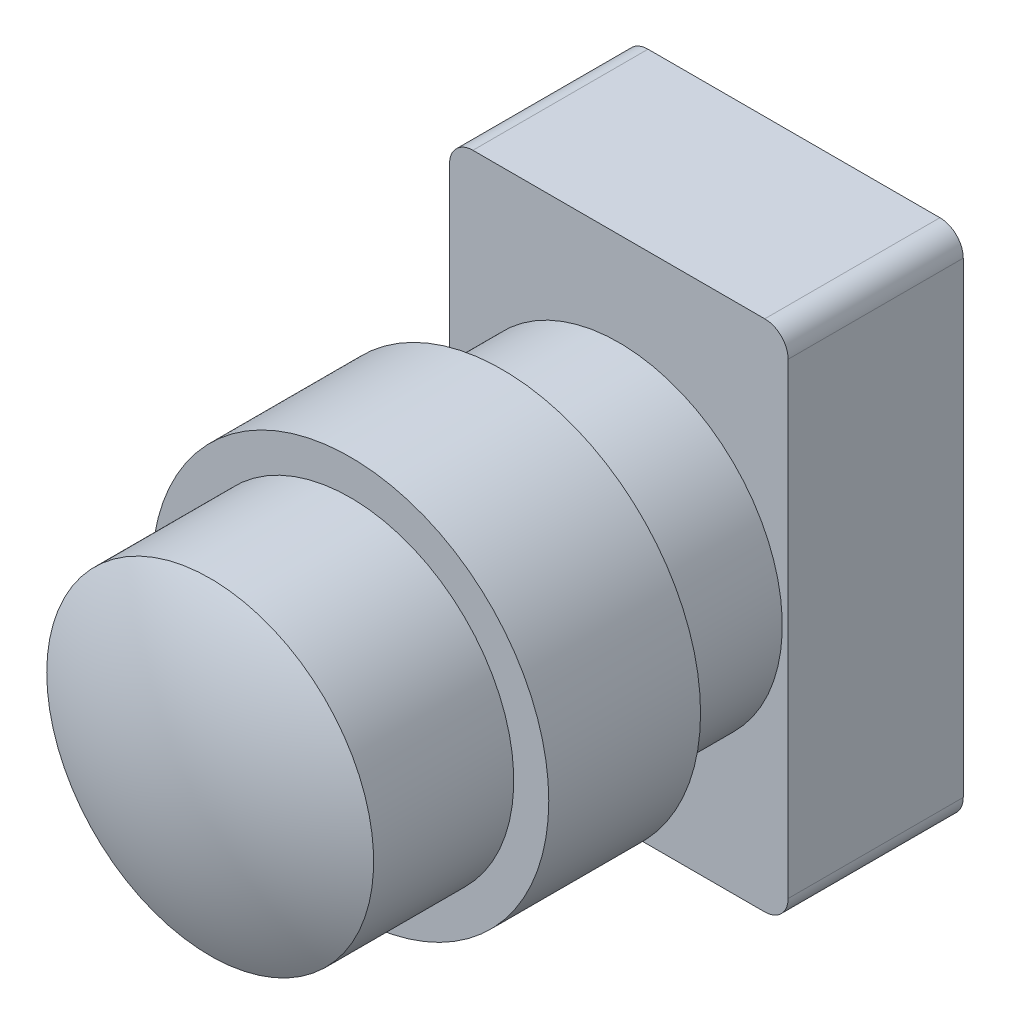
ISO-10303-21;
HEADER;
FILE_DESCRIPTION(('STEP AP214'),'2;1');
FILE_NAME('part.step','',(''),(''),'','','');
FILE_SCHEMA(('AUTOMOTIVE_DESIGN { 1 0 10303 214 1 1 1 1 }'));
ENDSEC;
DATA;
#1=APPLICATION_CONTEXT('core data for automotive mechanical design processes');
#2=APPLICATION_PROTOCOL_DEFINITION('international standard','automotive_design',2000,#1);
#3=PRODUCT_CONTEXT('',#1,'mechanical');
#4=PRODUCT('Part','Part','',(#3));
#5=PRODUCT_RELATED_PRODUCT_CATEGORY('part','',(#4));
#6=PRODUCT_DEFINITION_FORMATION('','',#4);
#7=PRODUCT_DEFINITION_CONTEXT('part definition',#1,'design');
#8=PRODUCT_DEFINITION('design','',#6,#7);
#9=PRODUCT_DEFINITION_SHAPE('','',#8);
#10=(LENGTH_UNIT() NAMED_UNIT(*) SI_UNIT(.MILLI.,.METRE.));
#11=(NAMED_UNIT(*) PLANE_ANGLE_UNIT() SI_UNIT($,.RADIAN.));
#12=(NAMED_UNIT(*) SI_UNIT($,.STERADIAN.) SOLID_ANGLE_UNIT());
#13=UNCERTAINTY_MEASURE_WITH_UNIT(LENGTH_MEASURE(1.E-05),#10,'distance_accuracy_value','');
#14=(GEOMETRIC_REPRESENTATION_CONTEXT(3) GLOBAL_UNCERTAINTY_ASSIGNED_CONTEXT((#13)) GLOBAL_UNIT_ASSIGNED_CONTEXT((#10,
#11,#12)) REPRESENTATION_CONTEXT('',''));
#15=CARTESIAN_POINT('',(0.,0.,0.));
#16=DIRECTION('',(0.,0.,1.));
#17=DIRECTION('',(1.,0.,0.));
#18=AXIS2_PLACEMENT_3D('',#15,#16,#17);
#19=CARTESIAN_POINT('',(43.5,-66.,-43.351388353));
#20=DIRECTION('',(0.,0.,-1.));
#21=DIRECTION('',(-1.,0.,0.));
#22=AXIS2_PLACEMENT_3D('',#19,#20,#21);
#23=PLANE('',#22);
#24=DIRECTION('',(0.,-1.,0.));
#25=VECTOR('',#24,1.);
#26=CARTESIAN_POINT('',(43.5,0.,-43.351388353));
#27=LINE('',#26,#25);
#28=CARTESIAN_POINT('',(43.5,60.,-43.351388353));
#29=VERTEX_POINT('',#28);
#30=CARTESIAN_POINT('',(43.5,-60.0000000012306,-43.351388353));
#31=VERTEX_POINT('',#30);
#32=EDGE_CURVE('E129',#29,#31,#27,.T.);
#33=ORIENTED_EDGE('',*,*,#32,.T.);
#34=CARTESIAN_POINT('',(37.5,-60.,-43.351388353));
#35=DIRECTION('',(0.,0.,-1.));
#36=DIRECTION('',(-1.,0.,0.));
#37=AXIS2_PLACEMENT_3D('',#34,#35,#36);
#38=CIRCLE('',#37,6.);
#39=CARTESIAN_POINT('',(37.5,-66.,-43.351388353));
#40=VERTEX_POINT('',#39);
#41=EDGE_CURVE('E124',#31,#40,#38,.T.);
#42=ORIENTED_EDGE('',*,*,#41,.T.);
#43=DIRECTION('',(-1.,0.,0.));
#44=VECTOR('',#43,1.);
#45=CARTESIAN_POINT('',(0.,-66.,-43.351388353));
#46=LINE('',#45,#44);
#47=CARTESIAN_POINT('',(-37.4999999988459,-66.,-43.351388353));
#48=VERTEX_POINT('',#47);
#49=EDGE_CURVE('E119',#40,#48,#46,.T.);
#50=ORIENTED_EDGE('',*,*,#49,.T.);
#51=CARTESIAN_POINT('',(-37.5,-60.,-43.351388353));
#52=DIRECTION('',(0.,0.,-1.));
#53=DIRECTION('',(-1.,0.,0.));
#54=AXIS2_PLACEMENT_3D('',#51,#52,#53);
#55=CIRCLE('',#54,6.00000000000001);
#56=CARTESIAN_POINT('',(-43.5,-60.,-43.351388353));
#57=VERTEX_POINT('',#56);
#58=EDGE_CURVE('E92',#48,#57,#55,.T.);
#59=ORIENTED_EDGE('',*,*,#58,.T.);
#60=DIRECTION('',(0.,1.,0.));
#61=VECTOR('',#60,1.);
#62=CARTESIAN_POINT('',(-43.5,0.,-43.351388353));
#63=LINE('',#62,#61);
#64=CARTESIAN_POINT('',(-43.5,60.,-43.351388353));
#65=VERTEX_POINT('',#64);
#66=EDGE_CURVE('E90',#57,#65,#63,.T.);
#67=ORIENTED_EDGE('',*,*,#66,.T.);
#68=CARTESIAN_POINT('',(-37.5,60.,-43.351388353));
#69=DIRECTION('',(0.,0.,-1.));
#70=DIRECTION('',(-1.,0.,0.));
#71=AXIS2_PLACEMENT_3D('',#68,#69,#70);
#72=CIRCLE('',#71,6.00000000000001);
#73=CARTESIAN_POINT('',(-37.5,66.,-43.351388353));
#74=VERTEX_POINT('',#73);
#75=EDGE_CURVE('E20',#65,#74,#72,.T.);
#76=ORIENTED_EDGE('',*,*,#75,.T.);
#77=DIRECTION('',(1.,0.,0.));
#78=VECTOR('',#77,1.);
#79=CARTESIAN_POINT('',(0.,66.,-43.351388353));
#80=LINE('',#79,#78);
#81=CARTESIAN_POINT('',(37.5000000006153,66.,-43.351388353));
#82=VERTEX_POINT('',#81);
#83=EDGE_CURVE('E139',#74,#82,#80,.T.);
#84=ORIENTED_EDGE('',*,*,#83,.T.);
#85=CARTESIAN_POINT('',(37.5,60.,-43.351388353));
#86=DIRECTION('',(0.,0.,-1.));
#87=DIRECTION('',(-1.,0.,0.));
#88=AXIS2_PLACEMENT_3D('',#85,#86,#87);
#89=CIRCLE('',#88,6.);
#90=EDGE_CURVE('E134',#82,#29,#89,.T.);
#91=ORIENTED_EDGE('',*,*,#90,.T.);
#92=EDGE_LOOP('',(#33,#42,#50,#59,#67,#76,#84,#91));
#93=FACE_BOUND('',#92,.T.);
#94=ADVANCED_FACE('F16',(#93),#23,.T.);
#95=CARTESIAN_POINT('',(-37.5,60.,1.648611647));
#96=DIRECTION('',(0.,0.,-1.));
#97=DIRECTION('',(-1.,0.,0.));
#98=AXIS2_PLACEMENT_3D('',#95,#96,#97);
#99=CYLINDRICAL_SURFACE('',#98,6.00000000000001);
#100=DIRECTION('',(0.,0.,-1.));
#101=VECTOR('',#100,1.);
#102=CARTESIAN_POINT('',(-37.5,66.,-20.851388353));
#103=LINE('',#102,#101);
#104=CARTESIAN_POINT('',(-37.5,66.,1.648611647));
#105=VERTEX_POINT('',#104);
#106=EDGE_CURVE('E85',#105,#74,#103,.T.);
#107=ORIENTED_EDGE('',*,*,#106,.T.);
#108=ORIENTED_EDGE('',*,*,#75,.F.);
#109=DIRECTION('',(0.,0.,1.));
#110=VECTOR('',#109,1.);
#111=CARTESIAN_POINT('',(-43.5,60.,-20.851388353));
#112=LINE('',#111,#110);
#113=CARTESIAN_POINT('',(-43.5,60.,1.648611647));
#114=VERTEX_POINT('',#113);
#115=EDGE_CURVE('E82',#65,#114,#112,.T.);
#116=ORIENTED_EDGE('',*,*,#115,.T.);
#117=CARTESIAN_POINT('',(-37.5,60.,1.648611647));
#118=DIRECTION('',(0.,0.,-1.));
#119=DIRECTION('',(-1.,0.,0.));
#120=AXIS2_PLACEMENT_3D('',#117,#118,#119);
#121=CIRCLE('',#120,6.00000000000001);
#122=EDGE_CURVE('E97',#114,#105,#121,.T.);
#123=ORIENTED_EDGE('',*,*,#122,.T.);
#124=EDGE_LOOP('',(#107,#108,#116,#123));
#125=FACE_BOUND('',#124,.T.);
#126=ADVANCED_FACE('F80',(#125),#99,.T.);
#127=CARTESIAN_POINT('',(-37.5,66.,1.648611647));
#128=DIRECTION('',(0.,-1.,0.));
#129=DIRECTION('',(0.,0.,-1.));
#130=AXIS2_PLACEMENT_3D('',#127,#128,#129);
#131=PLANE('',#130);
#132=ORIENTED_EDGE('',*,*,#106,.F.);
#133=DIRECTION('',(1.,0.,0.));
#134=VECTOR('',#133,1.);
#135=CARTESIAN_POINT('',(0.,66.,1.648611647));
#136=LINE('',#135,#134);
#137=CARTESIAN_POINT('',(37.5000000006153,66.,1.648611647));
#138=VERTEX_POINT('',#137);
#139=EDGE_CURVE('E177',#105,#138,#136,.T.);
#140=ORIENTED_EDGE('',*,*,#139,.T.);
#141=DIRECTION('',(0.,0.,1.));
#142=VECTOR('',#141,1.);
#143=CARTESIAN_POINT('',(37.5000000012306,66.,-20.851388353));
#144=LINE('',#143,#142);
#145=EDGE_CURVE('E135',#138,#82,#144,.F.);
#146=ORIENTED_EDGE('',*,*,#145,.T.);
#147=ORIENTED_EDGE('',*,*,#83,.F.);
#148=EDGE_LOOP('',(#132,#140,#146,#147));
#149=FACE_BOUND('',#148,.T.);
#150=ADVANCED_FACE('F217',(#149),#131,.F.);
#151=CARTESIAN_POINT('',(37.5,60.,1.648611647));
#152=DIRECTION('',(0.,0.,-1.));
#153=DIRECTION('',(-1.,0.,0.));
#154=AXIS2_PLACEMENT_3D('',#151,#152,#153);
#155=CYLINDRICAL_SURFACE('',#154,6.);
#156=DIRECTION('',(0.,0.,-1.));
#157=VECTOR('',#156,1.);
#158=CARTESIAN_POINT('',(43.5,60.,-20.851388353));
#159=LINE('',#158,#157);
#160=CARTESIAN_POINT('',(43.5,60.,1.648611647));
#161=VERTEX_POINT('',#160);
#162=EDGE_CURVE('E130',#161,#29,#159,.T.);
#163=ORIENTED_EDGE('',*,*,#162,.T.);
#164=ORIENTED_EDGE('',*,*,#90,.F.);
#165=ORIENTED_EDGE('',*,*,#145,.F.);
#166=CARTESIAN_POINT('',(37.5,60.,1.648611647));
#167=DIRECTION('',(0.,0.,-1.));
#168=DIRECTION('',(-1.,0.,0.));
#169=AXIS2_PLACEMENT_3D('',#166,#167,#168);
#170=CIRCLE('',#169,6.);
#171=EDGE_CURVE('E174',#138,#161,#170,.T.);
#172=ORIENTED_EDGE('',*,*,#171,.T.);
#173=EDGE_LOOP('',(#163,#164,#165,#172));
#174=FACE_BOUND('',#173,.T.);
#175=ADVANCED_FACE('F187',(#174),#155,.T.);
#176=CARTESIAN_POINT('',(43.5,-60.,-43.351388353));
#177=DIRECTION('',(-1.,0.,0.));
#178=DIRECTION('',(0.,0.,1.));
#179=AXIS2_PLACEMENT_3D('',#176,#177,#178);
#180=PLANE('',#179);
#181=DIRECTION('',(0.,0.,1.));
#182=VECTOR('',#181,1.);
#183=CARTESIAN_POINT('',(43.5,-60.0000000024612,-20.851388353));
#184=LINE('',#183,#182);
#185=CARTESIAN_POINT('',(43.5,-60.0000000012306,1.648611647));
#186=VERTEX_POINT('',#185);
#187=EDGE_CURVE('E125',#186,#31,#184,.F.);
#188=ORIENTED_EDGE('',*,*,#187,.T.);
#189=ORIENTED_EDGE('',*,*,#32,.F.);
#190=ORIENTED_EDGE('',*,*,#162,.F.);
#191=DIRECTION('',(0.,-1.,0.));
#192=VECTOR('',#191,1.);
#193=CARTESIAN_POINT('',(43.5,0.,1.648611647));
#194=LINE('',#193,#192);
#195=EDGE_CURVE('E173',#161,#186,#194,.T.);
#196=ORIENTED_EDGE('',*,*,#195,.T.);
#197=EDGE_LOOP('',(#188,#189,#190,#196));
#198=FACE_BOUND('',#197,.T.);
#199=ADVANCED_FACE('F191',(#198),#180,.F.);
#200=CARTESIAN_POINT('',(37.5,-60.,1.648611647));
#201=DIRECTION('',(0.,0.,-1.));
#202=DIRECTION('',(-1.,0.,0.));
#203=AXIS2_PLACEMENT_3D('',#200,#201,#202);
#204=CYLINDRICAL_SURFACE('',#203,6.);
#205=DIRECTION('',(0.,0.,-1.));
#206=VECTOR('',#205,1.);
#207=CARTESIAN_POINT('',(37.5,-66.,-20.851388353));
#208=LINE('',#207,#206);
#209=CARTESIAN_POINT('',(37.5,-66.,1.648611647));
#210=VERTEX_POINT('',#209);
#211=EDGE_CURVE('E120',#210,#40,#208,.T.);
#212=ORIENTED_EDGE('',*,*,#211,.T.);
#213=ORIENTED_EDGE('',*,*,#41,.F.);
#214=ORIENTED_EDGE('',*,*,#187,.F.);
#215=CARTESIAN_POINT('',(37.5,-60.,1.648611647));
#216=DIRECTION('',(0.,0.,-1.));
#217=DIRECTION('',(-1.,0.,0.));
#218=AXIS2_PLACEMENT_3D('',#215,#216,#217);
#219=CIRCLE('',#218,6.);
#220=EDGE_CURVE('E170',#186,#210,#219,.T.);
#221=ORIENTED_EDGE('',*,*,#220,.T.);
#222=EDGE_LOOP('',(#212,#213,#214,#221));
#223=FACE_BOUND('',#222,.T.);
#224=ADVANCED_FACE('F196',(#223),#204,.T.);
#225=CARTESIAN_POINT('',(-37.5,-66.,-43.351388353));
#226=DIRECTION('',(0.,1.,0.));
#227=DIRECTION('',(0.,0.,1.));
#228=AXIS2_PLACEMENT_3D('',#225,#226,#227);
#229=PLANE('',#228);
#230=DIRECTION('',(0.,0.,1.));
#231=VECTOR('',#230,1.);
#232=CARTESIAN_POINT('',(-37.4999999976919,-66.,-20.851388353));
#233=LINE('',#232,#231);
#234=CARTESIAN_POINT('',(-37.4999999988459,-66.,1.648611647));
#235=VERTEX_POINT('',#234);
#236=EDGE_CURVE('E112',#235,#48,#233,.F.);
#237=ORIENTED_EDGE('',*,*,#236,.T.);
#238=ORIENTED_EDGE('',*,*,#49,.F.);
#239=ORIENTED_EDGE('',*,*,#211,.F.);
#240=DIRECTION('',(-1.,0.,0.));
#241=VECTOR('',#240,1.);
#242=CARTESIAN_POINT('',(0.,-66.,1.648611647));
#243=LINE('',#242,#241);
#244=EDGE_CURVE('E169',#210,#235,#243,.T.);
#245=ORIENTED_EDGE('',*,*,#244,.T.);
#246=EDGE_LOOP('',(#237,#238,#239,#245));
#247=FACE_BOUND('',#246,.T.);
#248=ADVANCED_FACE('F201',(#247),#229,.F.);
#249=CARTESIAN_POINT('',(-37.5,-60.,1.648611647));
#250=DIRECTION('',(0.,0.,-1.));
#251=DIRECTION('',(-1.,0.,0.));
#252=AXIS2_PLACEMENT_3D('',#249,#250,#251);
#253=CYLINDRICAL_SURFACE('',#252,6.00000000000001);
#254=DIRECTION('',(0.,0.,-1.));
#255=VECTOR('',#254,1.);
#256=CARTESIAN_POINT('',(-43.5,-60.,-20.851388353));
#257=LINE('',#256,#255);
#258=CARTESIAN_POINT('',(-43.5,-60.,1.648611647));
#259=VERTEX_POINT('',#258);
#260=EDGE_CURVE('E98',#259,#57,#257,.T.);
#261=ORIENTED_EDGE('',*,*,#260,.T.);
#262=ORIENTED_EDGE('',*,*,#58,.F.);
#263=ORIENTED_EDGE('',*,*,#236,.F.);
#264=CARTESIAN_POINT('',(-37.5,-60.,1.648611647));
#265=DIRECTION('',(0.,0.,-1.));
#266=DIRECTION('',(-1.,0.,0.));
#267=AXIS2_PLACEMENT_3D('',#264,#265,#266);
#268=CIRCLE('',#267,6.00000000000001);
#269=EDGE_CURVE('E167',#235,#259,#268,.T.);
#270=ORIENTED_EDGE('',*,*,#269,.T.);
#271=EDGE_LOOP('',(#261,#262,#263,#270));
#272=FACE_BOUND('',#271,.T.);
#273=ADVANCED_FACE('F205',(#272),#253,.T.);
#274=CARTESIAN_POINT('',(-43.5,-60.,1.648611647));
#275=DIRECTION('',(1.,0.,0.));
#276=DIRECTION('',(0.,0.,-1.));
#277=AXIS2_PLACEMENT_3D('',#274,#275,#276);
#278=PLANE('',#277);
#279=ORIENTED_EDGE('',*,*,#260,.F.);
#280=DIRECTION('',(0.,1.,0.));
#281=VECTOR('',#280,1.);
#282=CARTESIAN_POINT('',(-43.5,0.,1.648611647));
#283=LINE('',#282,#281);
#284=EDGE_CURVE('E102',#259,#114,#283,.T.);
#285=ORIENTED_EDGE('',*,*,#284,.T.);
#286=ORIENTED_EDGE('',*,*,#115,.F.);
#287=ORIENTED_EDGE('',*,*,#66,.F.);
#288=EDGE_LOOP('',(#279,#285,#286,#287));
#289=FACE_BOUND('',#288,.T.);
#290=ADVANCED_FACE('F100',(#289),#278,.F.);
#291=CARTESIAN_POINT('',(43.5,-66.,1.648611647));
#292=DIRECTION('',(0.,0.,-1.));
#293=DIRECTION('',(-1.,0.,0.));
#294=AXIS2_PLACEMENT_3D('',#291,#292,#293);
#295=PLANE('',#294);
#296=CARTESIAN_POINT('',(0.,0.,1.648611647));
#297=DIRECTION('',(0.,0.,-1.));
#298=DIRECTION('',(-1.,0.,0.));
#299=AXIS2_PLACEMENT_3D('',#296,#297,#298);
#300=CIRCLE('',#299,42.);
#301=CARTESIAN_POINT('',(-42.,0.,1.648611647));
#302=VERTEX_POINT('',#301);
#303=EDGE_CURVE('E163',#302,#302,#300,.T.);
#304=ORIENTED_EDGE('',*,*,#303,.T.);
#305=EDGE_LOOP('',(#304));
#306=FACE_BOUND('',#305,.T.);
#307=ORIENTED_EDGE('',*,*,#269,.F.);
#308=ORIENTED_EDGE('',*,*,#244,.F.);
#309=ORIENTED_EDGE('',*,*,#220,.F.);
#310=ORIENTED_EDGE('',*,*,#195,.F.);
#311=ORIENTED_EDGE('',*,*,#171,.F.);
#312=ORIENTED_EDGE('',*,*,#139,.F.);
#313=ORIENTED_EDGE('',*,*,#122,.F.);
#314=ORIENTED_EDGE('',*,*,#284,.F.);
#315=EDGE_LOOP('',(#307,#308,#309,#310,#311,#312,#313,#314));
#316=FACE_BOUND('',#315,.T.);
#317=ADVANCED_FACE('F207',(#306,#316),#295,.F.);
#318=CARTESIAN_POINT('',(0.,0.,31.648611647));
#319=DIRECTION('',(0.,0.,-1.));
#320=DIRECTION('',(-1.,0.,0.));
#321=AXIS2_PLACEMENT_3D('',#318,#319,#320);
#322=CYLINDRICAL_SURFACE('',#321,42.);
#323=CARTESIAN_POINT('',(0.,0.,31.648611647));
#324=DIRECTION('',(0.,0.,-1.));
#325=DIRECTION('',(-1.,0.,0.));
#326=AXIS2_PLACEMENT_3D('',#323,#324,#325);
#327=CIRCLE('',#326,42.);
#328=CARTESIAN_POINT('',(-42.,0.,31.648611647));
#329=VERTEX_POINT('',#328);
#330=EDGE_CURVE('E159',#329,#329,#327,.T.);
#331=ORIENTED_EDGE('',*,*,#330,.T.);
#332=EDGE_LOOP('',(#331));
#333=FACE_BOUND('',#332,.T.);
#334=ORIENTED_EDGE('',*,*,#303,.F.);
#335=EDGE_LOOP('',(#334));
#336=FACE_BOUND('',#335,.T.);
#337=ADVANCED_FACE('F247',(#333,#336),#322,.T.);
#338=CARTESIAN_POINT('',(-51.612,-51.612,31.648611647));
#339=DIRECTION('',(0.,0.,1.));
#340=DIRECTION('',(1.,0.,0.));
#341=AXIS2_PLACEMENT_3D('',#338,#339,#340);
#342=PLANE('',#341);
#343=ORIENTED_EDGE('',*,*,#330,.F.);
#344=EDGE_LOOP('',(#343));
#345=FACE_BOUND('',#344,.T.);
#346=CARTESIAN_POINT('',(0.,0.,31.648611647));
#347=DIRECTION('',(0.,0.,1.));
#348=DIRECTION('',(1.,0.,0.));
#349=AXIS2_PLACEMENT_3D('',#346,#347,#348);
#350=CIRCLE('',#349,51.);
#351=CARTESIAN_POINT('',(51.,0.,31.648611647));
#352=VERTEX_POINT('',#351);
#353=EDGE_CURVE('E155',#352,#352,#350,.F.);
#354=ORIENTED_EDGE('',*,*,#353,.T.);
#355=EDGE_LOOP('',(#354));
#356=FACE_BOUND('',#355,.T.);
#357=ADVANCED_FACE('F245',(#345,#356),#342,.F.);
#358=CARTESIAN_POINT('',(0.,0.,31.648611647));
#359=DIRECTION('',(0.,0.,1.));
#360=DIRECTION('',(1.,0.,0.));
#361=AXIS2_PLACEMENT_3D('',#358,#359,#360);
#362=CYLINDRICAL_SURFACE('',#361,51.);
#363=ORIENTED_EDGE('',*,*,#353,.F.);
#364=EDGE_LOOP('',(#363));
#365=FACE_BOUND('',#364,.T.);
#366=CARTESIAN_POINT('',(0.,0.,70.648611647));
#367=DIRECTION('',(0.,0.,1.));
#368=DIRECTION('',(1.,0.,0.));
#369=AXIS2_PLACEMENT_3D('',#366,#367,#368);
#370=CIRCLE('',#369,51.);
#371=CARTESIAN_POINT('',(51.,0.,70.648611647));
#372=VERTEX_POINT('',#371);
#373=EDGE_CURVE('E151',#372,#372,#370,.T.);
#374=ORIENTED_EDGE('',*,*,#373,.F.);
#375=EDGE_LOOP('',(#374));
#376=FACE_BOUND('',#375,.T.);
#377=ADVANCED_FACE('F241',(#365,#376),#362,.T.);
#378=CARTESIAN_POINT('',(-51.612,-51.612,70.648611647));
#379=DIRECTION('',(0.,0.,1.));
#380=DIRECTION('',(1.,0.,0.));
#381=AXIS2_PLACEMENT_3D('',#378,#379,#380);
#382=PLANE('',#381);
#383=CARTESIAN_POINT('',(0.,0.,70.648611647));
#384=DIRECTION('',(0.,0.,-1.));
#385=DIRECTION('',(-1.,0.,0.));
#386=AXIS2_PLACEMENT_3D('',#383,#384,#385);
#387=CIRCLE('',#386,42.);
#388=CARTESIAN_POINT('',(-42.,0.,70.648611647));
#389=VERTEX_POINT('',#388);
#390=EDGE_CURVE('E27',#389,#389,#387,.T.);
#391=ORIENTED_EDGE('',*,*,#390,.T.);
#392=EDGE_LOOP('',(#391));
#393=FACE_BOUND('',#392,.T.);
#394=ORIENTED_EDGE('',*,*,#373,.T.);
#395=EDGE_LOOP('',(#394));
#396=FACE_BOUND('',#395,.T.);
#397=ADVANCED_FACE('F18',(#393,#396),#382,.T.);
#398=CARTESIAN_POINT('',(0.,-1.64103397537474E-10,23.4486116468359));
#399=DIRECTION('',(0.,0.,1.));
#400=DIRECTION('',(-1.,0.,0.));
#401=AXIS2_PLACEMENT_3D('',#398,#399,#400);
#402=SPHERICAL_SURFACE('',#401,93.2);
#403=CARTESIAN_POINT('',(8.93767408897249E-07,0.,116.648611646836));
#404=VERTEX_POINT('',#403);
#405=VERTEX_LOOP('',#404);
#406=FACE_BOUND('',#405,.T.);
#407=CARTESIAN_POINT('',(0.,0.,106.648611647));
#408=DIRECTION('',(0.,0.,-1.));
#409=DIRECTION('',(-1.,0.,0.));
#410=AXIS2_PLACEMENT_3D('',#407,#408,#409);
#411=CIRCLE('',#410,42.);
#412=CARTESIAN_POINT('',(-42.,0.,106.648611647));
#413=VERTEX_POINT('',#412);
#414=EDGE_CURVE('E11',#413,#413,#411,.F.);
#415=ORIENTED_EDGE('',*,*,#414,.T.);
#416=EDGE_LOOP('',(#415));
#417=FACE_BOUND('',#416,.T.);
#418=ADVANCED_FACE('F231',(#406,#417),#402,.T.);
#419=CARTESIAN_POINT('',(0.,0.,106.648611647));
#420=DIRECTION('',(0.,0.,-1.));
#421=DIRECTION('',(-1.,0.,0.));
#422=AXIS2_PLACEMENT_3D('',#419,#420,#421);
#423=CYLINDRICAL_SURFACE('',#422,42.);
#424=ORIENTED_EDGE('',*,*,#390,.F.);
#425=EDGE_LOOP('',(#424));
#426=FACE_BOUND('',#425,.T.);
#427=ORIENTED_EDGE('',*,*,#414,.F.);
#428=EDGE_LOOP('',(#427));
#429=FACE_BOUND('',#428,.T.);
#430=ADVANCED_FACE('F229',(#426,#429),#423,.T.);
#431=CLOSED_SHELL('',(#94,#126,#150,#175,#199,#224,#248,#273,#290,#317,#337,#357,#377,#397,#418,#430));
#432=MANIFOLD_SOLID_BREP('B1',#431);
#433=ADVANCED_BREP_SHAPE_REPRESENTATION('',(#18,#432),#14);
#434=SHAPE_DEFINITION_REPRESENTATION(#9,#433);
ENDSEC;
END-ISO-10303-21;
